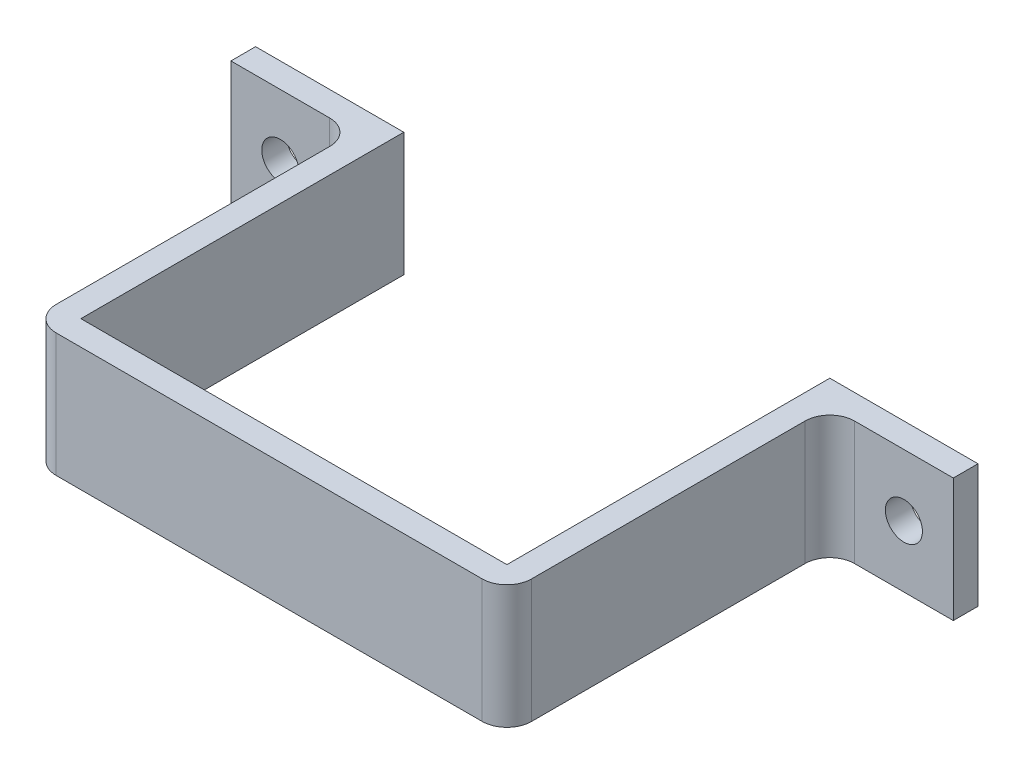
ISO-10303-21;
HEADER;
FILE_DESCRIPTION(('STEP AP214'),'2;1');
FILE_NAME('part.step','',(''),(''),'','','');
FILE_SCHEMA(('AUTOMOTIVE_DESIGN { 1 0 10303 214 1 1 1 1 }'));
ENDSEC;
DATA;
#1=APPLICATION_CONTEXT('core data for automotive mechanical design processes');
#2=APPLICATION_PROTOCOL_DEFINITION('international standard','automotive_design',2000,#1);
#3=PRODUCT_CONTEXT('',#1,'mechanical');
#4=PRODUCT('Part','Part','',(#3));
#5=PRODUCT_RELATED_PRODUCT_CATEGORY('part','',(#4));
#6=PRODUCT_DEFINITION_FORMATION('','',#4);
#7=PRODUCT_DEFINITION_CONTEXT('part definition',#1,'design');
#8=PRODUCT_DEFINITION('design','',#6,#7);
#9=PRODUCT_DEFINITION_SHAPE('','',#8);
#10=(LENGTH_UNIT() NAMED_UNIT(*) SI_UNIT(.MILLI.,.METRE.));
#11=(NAMED_UNIT(*) PLANE_ANGLE_UNIT() SI_UNIT($,.RADIAN.));
#12=(NAMED_UNIT(*) SI_UNIT($,.STERADIAN.) SOLID_ANGLE_UNIT());
#13=UNCERTAINTY_MEASURE_WITH_UNIT(LENGTH_MEASURE(1.E-05),#10,'distance_accuracy_value','');
#14=(GEOMETRIC_REPRESENTATION_CONTEXT(3) GLOBAL_UNCERTAINTY_ASSIGNED_CONTEXT((#13)) GLOBAL_UNIT_ASSIGNED_CONTEXT((#10,
#11,#12)) REPRESENTATION_CONTEXT('',''));
#15=CARTESIAN_POINT('',(0.,0.,0.));
#16=DIRECTION('',(0.,0.,1.));
#17=DIRECTION('',(1.,0.,0.));
#18=AXIS2_PLACEMENT_3D('',#15,#16,#17);
#19=CARTESIAN_POINT('',(0.,10.5450871627875,2.15));
#20=DIRECTION('',(0.,1.,0.));
#21=DIRECTION('',(0.,0.,1.));
#22=AXIS2_PLACEMENT_3D('',#19,#20,#21);
#23=PLANE('',#22);
#24=DIRECTION('',(0.,0.,1.));
#25=VECTOR('',#24,1.);
#26=CARTESIAN_POINT('',(-19.25,10.5450871627875,-36.1980390271856));
#27=LINE('',#26,#25);
#28=CARTESIAN_POINT('',(-19.25,10.5450871627875,-22.));
#29=VERTEX_POINT('',#28);
#30=CARTESIAN_POINT('',(-19.25,10.5450871627875,0.149999999999983));
#31=VERTEX_POINT('',#30);
#32=EDGE_CURVE('E244',#29,#31,#27,.T.);
#33=ORIENTED_EDGE('',*,*,#32,.T.);
#34=CARTESIAN_POINT('',(-17.25,10.5450871627875,0.15));
#35=DIRECTION('',(0.,1.,0.));
#36=DIRECTION('',(0.,0.,1.));
#37=AXIS2_PLACEMENT_3D('',#34,#35,#36);
#38=CIRCLE('',#37,2.);
#39=CARTESIAN_POINT('',(-17.25,10.5450871627875,2.15));
#40=VERTEX_POINT('',#39);
#41=EDGE_CURVE('E314',#31,#40,#38,.T.);
#42=ORIENTED_EDGE('',*,*,#41,.T.);
#43=DIRECTION('',(1.,0.,0.));
#44=VECTOR('',#43,1.);
#45=CARTESIAN_POINT('',(0.,10.5450871627875,2.15));
#46=LINE('',#45,#44);
#47=CARTESIAN_POINT('',(17.25,10.5450871627875,2.15));
#48=VERTEX_POINT('',#47);
#49=EDGE_CURVE('E267',#40,#48,#46,.T.);
#50=ORIENTED_EDGE('',*,*,#49,.T.);
#51=CARTESIAN_POINT('',(17.25,10.5450871627875,0.149999999999997));
#52=DIRECTION('',(0.,1.,0.));
#53=DIRECTION('',(0.,0.,1.));
#54=AXIS2_PLACEMENT_3D('',#51,#52,#53);
#55=CIRCLE('',#54,2.);
#56=CARTESIAN_POINT('',(19.25,10.5450871627875,0.149999999999983));
#57=VERTEX_POINT('',#56);
#58=EDGE_CURVE('E71',#48,#57,#55,.T.);
#59=ORIENTED_EDGE('',*,*,#58,.T.);
#60=DIRECTION('',(0.,0.,1.));
#61=VECTOR('',#60,1.);
#62=CARTESIAN_POINT('',(19.25,10.5450871627875,-36.1980390271856));
#63=LINE('',#62,#61);
#64=CARTESIAN_POINT('',(19.25,10.5450871627875,-22.));
#65=VERTEX_POINT('',#64);
#66=EDGE_CURVE('E232',#65,#57,#63,.T.);
#67=ORIENTED_EDGE('',*,*,#66,.F.);
#68=CARTESIAN_POINT('',(21.25,10.5450871627875,-22.));
#69=DIRECTION('',(0.,1.,0.));
#70=DIRECTION('',(0.,0.,1.));
#71=AXIS2_PLACEMENT_3D('',#68,#69,#70);
#72=CIRCLE('',#71,2.);
#73=CARTESIAN_POINT('',(21.25,10.5450871627875,-24.));
#74=VERTEX_POINT('',#73);
#75=EDGE_CURVE('E58',#65,#74,#72,.F.);
#76=ORIENTED_EDGE('',*,*,#75,.T.);
#77=DIRECTION('',(-1.,0.,0.));
#78=VECTOR('',#77,1.);
#79=CARTESIAN_POINT('',(29.25,10.5450871627875,-24.));
#80=LINE('',#79,#78);
#81=CARTESIAN_POINT('',(29.25,10.5450871627875,-24.));
#82=VERTEX_POINT('',#81);
#83=EDGE_CURVE('E187',#82,#74,#80,.T.);
#84=ORIENTED_EDGE('',*,*,#83,.F.);
#85=DIRECTION('',(0.,0.,-1.));
#86=VECTOR('',#85,1.);
#87=CARTESIAN_POINT('',(29.25,10.5450871627875,-26.));
#88=LINE('',#87,#86);
#89=CARTESIAN_POINT('',(29.25,10.5450871627875,-26.));
#90=VERTEX_POINT('',#89);
#91=EDGE_CURVE('E179',#82,#90,#88,.T.);
#92=ORIENTED_EDGE('',*,*,#91,.T.);
#93=DIRECTION('',(1.,0.,0.));
#94=VECTOR('',#93,1.);
#95=CARTESIAN_POINT('',(0.,10.5450871627876,-26.));
#96=LINE('',#95,#94);
#97=CARTESIAN_POINT('',(17.25,10.5450871627875,-26.));
#98=VERTEX_POINT('',#97);
#99=EDGE_CURVE('E163',#98,#90,#96,.T.);
#100=ORIENTED_EDGE('',*,*,#99,.F.);
#101=DIRECTION('',(0.,0.,1.));
#102=VECTOR('',#101,1.);
#103=CARTESIAN_POINT('',(17.25,10.5450871627875,-36.1980390271856));
#104=LINE('',#103,#102);
#105=CARTESIAN_POINT('',(17.25,10.5450871627875,0.149999999999983));
#106=VERTEX_POINT('',#105);
#107=EDGE_CURVE('E173',#98,#106,#104,.T.);
#108=ORIENTED_EDGE('',*,*,#107,.T.);
#109=DIRECTION('',(1.,0.,0.));
#110=VECTOR('',#109,1.);
#111=CARTESIAN_POINT('',(0.,10.5450871627875,0.15));
#112=LINE('',#111,#110);
#113=CARTESIAN_POINT('',(-17.25,10.5450871627875,0.15));
#114=VERTEX_POINT('',#113);
#115=EDGE_CURVE('E228',#114,#106,#112,.T.);
#116=ORIENTED_EDGE('',*,*,#115,.F.);
#117=DIRECTION('',(0.,0.,1.));
#118=VECTOR('',#117,1.);
#119=CARTESIAN_POINT('',(-17.25,10.5450871627875,-36.1980390271856));
#120=LINE('',#119,#118);
#121=CARTESIAN_POINT('',(-17.25,10.5450871627875,-26.));
#122=VERTEX_POINT('',#121);
#123=EDGE_CURVE('E248',#122,#114,#120,.T.);
#124=ORIENTED_EDGE('',*,*,#123,.F.);
#125=DIRECTION('',(-1.,0.,0.));
#126=VECTOR('',#125,1.);
#127=CARTESIAN_POINT('',(0.,10.5450871627876,-26.));
#128=LINE('',#127,#126);
#129=CARTESIAN_POINT('',(-29.25,10.5450871627875,-26.));
#130=VERTEX_POINT('',#129);
#131=EDGE_CURVE('E245',#122,#130,#128,.T.);
#132=ORIENTED_EDGE('',*,*,#131,.T.);
#133=DIRECTION('',(0.,0.,-1.));
#134=VECTOR('',#133,1.);
#135=CARTESIAN_POINT('',(-29.25,10.5450871627875,-26.));
#136=LINE('',#135,#134);
#137=CARTESIAN_POINT('',(-29.25,10.5450871627875,-24.));
#138=VERTEX_POINT('',#137);
#139=EDGE_CURVE('E213',#138,#130,#136,.T.);
#140=ORIENTED_EDGE('',*,*,#139,.F.);
#141=DIRECTION('',(1.,0.,0.));
#142=VECTOR('',#141,1.);
#143=CARTESIAN_POINT('',(-29.25,10.5450871627875,-24.));
#144=LINE('',#143,#142);
#145=CARTESIAN_POINT('',(-21.25,10.5450871627875,-24.));
#146=VERTEX_POINT('',#145);
#147=EDGE_CURVE('E217',#138,#146,#144,.T.);
#148=ORIENTED_EDGE('',*,*,#147,.T.);
#149=CARTESIAN_POINT('',(-21.25,10.5450871627875,-22.));
#150=DIRECTION('',(0.,1.,0.));
#151=DIRECTION('',(0.,0.,1.));
#152=AXIS2_PLACEMENT_3D('',#149,#150,#151);
#153=CIRCLE('',#152,2.);
#154=EDGE_CURVE('E328',#146,#29,#153,.F.);
#155=ORIENTED_EDGE('',*,*,#154,.T.);
#156=EDGE_LOOP('',(#33,#42,#50,#59,#67,#76,#84,#92,#100,#108,#116,#124,#132,#140,#148,#155));
#157=FACE_BOUND('',#156,.T.);
#158=ADVANCED_FACE('F48',(#157),#23,.T.);
#159=CARTESIAN_POINT('',(0.,0.545087162787469,2.15));
#160=DIRECTION('',(0.,1.,0.));
#161=DIRECTION('',(0.,0.,1.));
#162=AXIS2_PLACEMENT_3D('',#159,#160,#161);
#163=PLANE('',#162);
#164=DIRECTION('',(1.,0.,0.));
#165=VECTOR('',#164,1.);
#166=CARTESIAN_POINT('',(0.,0.545087162787469,2.15));
#167=LINE('',#166,#165);
#168=CARTESIAN_POINT('',(-17.25,0.545087162787469,2.15));
#169=VERTEX_POINT('',#168);
#170=CARTESIAN_POINT('',(17.25,0.545087162787469,2.15));
#171=VERTEX_POINT('',#170);
#172=EDGE_CURVE('E270',#169,#171,#167,.T.);
#173=ORIENTED_EDGE('',*,*,#172,.F.);
#174=CARTESIAN_POINT('',(-17.25,0.545087162787469,0.15));
#175=DIRECTION('',(0.,1.,0.));
#176=DIRECTION('',(0.,0.,1.));
#177=AXIS2_PLACEMENT_3D('',#174,#175,#176);
#178=CIRCLE('',#177,2.);
#179=CARTESIAN_POINT('',(-19.25,0.545087162787448,0.149999999999983));
#180=VERTEX_POINT('',#179);
#181=EDGE_CURVE('E309',#169,#180,#178,.F.);
#182=ORIENTED_EDGE('',*,*,#181,.T.);
#183=DIRECTION('',(0.,0.,1.));
#184=VECTOR('',#183,1.);
#185=CARTESIAN_POINT('',(-19.25,0.545087162787448,-36.1980390271856));
#186=LINE('',#185,#184);
#187=CARTESIAN_POINT('',(-19.25,0.545087162787448,-22.));
#188=VERTEX_POINT('',#187);
#189=EDGE_CURVE('E254',#188,#180,#186,.T.);
#190=ORIENTED_EDGE('',*,*,#189,.F.);
#191=CARTESIAN_POINT('',(-21.25,0.545087162787469,-22.));
#192=DIRECTION('',(0.,1.,0.));
#193=DIRECTION('',(0.,0.,1.));
#194=AXIS2_PLACEMENT_3D('',#191,#192,#193);
#195=CIRCLE('',#194,2.);
#196=CARTESIAN_POINT('',(-21.25,0.545087162787448,-24.));
#197=VERTEX_POINT('',#196);
#198=EDGE_CURVE('E331',#188,#197,#195,.T.);
#199=ORIENTED_EDGE('',*,*,#198,.T.);
#200=DIRECTION('',(1.,0.,0.));
#201=VECTOR('',#200,1.);
#202=CARTESIAN_POINT('',(-29.25,0.545087162787448,-24.));
#203=LINE('',#202,#201);
#204=CARTESIAN_POINT('',(-29.25,0.545087162787448,-24.));
#205=VERTEX_POINT('',#204);
#206=EDGE_CURVE('E221',#205,#197,#203,.T.);
#207=ORIENTED_EDGE('',*,*,#206,.F.);
#208=DIRECTION('',(0.,0.,1.));
#209=VECTOR('',#208,1.);
#210=CARTESIAN_POINT('',(-29.25,0.545087162787448,-26.));
#211=LINE('',#210,#209);
#212=CARTESIAN_POINT('',(-29.25,0.545087162787448,-26.));
#213=VERTEX_POINT('',#212);
#214=EDGE_CURVE('E207',#213,#205,#211,.T.);
#215=ORIENTED_EDGE('',*,*,#214,.F.);
#216=DIRECTION('',(-1.,0.,0.));
#217=VECTOR('',#216,1.);
#218=CARTESIAN_POINT('',(0.,0.545087162787655,-26.));
#219=LINE('',#218,#217);
#220=CARTESIAN_POINT('',(-17.25,0.545087162787469,-26.));
#221=VERTEX_POINT('',#220);
#222=EDGE_CURVE('E251',#221,#213,#219,.T.);
#223=ORIENTED_EDGE('',*,*,#222,.F.);
#224=DIRECTION('',(0.,0.,1.));
#225=VECTOR('',#224,1.);
#226=CARTESIAN_POINT('',(-17.25,0.545087162787469,-36.1980390271856));
#227=LINE('',#226,#225);
#228=CARTESIAN_POINT('',(-17.25,0.545087162787469,0.149999999999983));
#229=VERTEX_POINT('',#228);
#230=EDGE_CURVE('E258',#221,#229,#227,.T.);
#231=ORIENTED_EDGE('',*,*,#230,.T.);
#232=DIRECTION('',(1.,0.,0.));
#233=VECTOR('',#232,1.);
#234=CARTESIAN_POINT('',(0.,0.545087162787469,0.15));
#235=LINE('',#234,#233);
#236=CARTESIAN_POINT('',(17.25,0.545087162787469,0.15));
#237=VERTEX_POINT('',#236);
#238=EDGE_CURVE('E283',#229,#237,#235,.T.);
#239=ORIENTED_EDGE('',*,*,#238,.T.);
#240=DIRECTION('',(0.,0.,1.));
#241=VECTOR('',#240,1.);
#242=CARTESIAN_POINT('',(17.25,0.545087162787469,-36.1980390271856));
#243=LINE('',#242,#241);
#244=CARTESIAN_POINT('',(17.25,0.545087162787469,-26.));
#245=VERTEX_POINT('',#244);
#246=EDGE_CURVE('E237',#245,#237,#243,.T.);
#247=ORIENTED_EDGE('',*,*,#246,.F.);
#248=DIRECTION('',(1.,0.,0.));
#249=VECTOR('',#248,1.);
#250=CARTESIAN_POINT('',(0.,0.545087162787617,-26.));
#251=LINE('',#250,#249);
#252=CARTESIAN_POINT('',(29.25,0.545087162787448,-26.));
#253=VERTEX_POINT('',#252);
#254=EDGE_CURVE('E229',#245,#253,#251,.T.);
#255=ORIENTED_EDGE('',*,*,#254,.T.);
#256=DIRECTION('',(0.,0.,1.));
#257=VECTOR('',#256,1.);
#258=CARTESIAN_POINT('',(29.25,0.545087162787448,-26.));
#259=LINE('',#258,#257);
#260=CARTESIAN_POINT('',(29.25,0.545087162787448,-24.));
#261=VERTEX_POINT('',#260);
#262=EDGE_CURVE('E182',#253,#261,#259,.T.);
#263=ORIENTED_EDGE('',*,*,#262,.T.);
#264=DIRECTION('',(-1.,0.,0.));
#265=VECTOR('',#264,1.);
#266=CARTESIAN_POINT('',(29.25,0.545087162787448,-24.));
#267=LINE('',#266,#265);
#268=CARTESIAN_POINT('',(21.25,0.545087162787448,-24.));
#269=VERTEX_POINT('',#268);
#270=EDGE_CURVE('E197',#261,#269,#267,.T.);
#271=ORIENTED_EDGE('',*,*,#270,.T.);
#272=CARTESIAN_POINT('',(21.25,0.545087162787469,-22.));
#273=DIRECTION('',(0.,1.,0.));
#274=DIRECTION('',(0.,0.,1.));
#275=AXIS2_PLACEMENT_3D('',#272,#273,#274);
#276=CIRCLE('',#275,2.);
#277=CARTESIAN_POINT('',(19.25,0.545087162787452,-22.));
#278=VERTEX_POINT('',#277);
#279=EDGE_CURVE('E12',#269,#278,#276,.T.);
#280=ORIENTED_EDGE('',*,*,#279,.T.);
#281=DIRECTION('',(0.,0.,1.));
#282=VECTOR('',#281,1.);
#283=CARTESIAN_POINT('',(19.25,0.545087162787452,-36.1980390271856));
#284=LINE('',#283,#282);
#285=CARTESIAN_POINT('',(19.25,0.545087162787452,0.149999999999983));
#286=VERTEX_POINT('',#285);
#287=EDGE_CURVE('E231',#278,#286,#284,.T.);
#288=ORIENTED_EDGE('',*,*,#287,.T.);
#289=CARTESIAN_POINT('',(17.25,0.545087162787469,0.149999999999997));
#290=DIRECTION('',(0.,1.,0.));
#291=DIRECTION('',(0.,0.,1.));
#292=AXIS2_PLACEMENT_3D('',#289,#290,#291);
#293=CIRCLE('',#292,2.);
#294=EDGE_CURVE('E306',#286,#171,#293,.F.);
#295=ORIENTED_EDGE('',*,*,#294,.T.);
#296=EDGE_LOOP('',(#173,#182,#190,#199,#207,#215,#223,#231,#239,#247,#255,#263,#271,#280,#288,#295));
#297=FACE_BOUND('',#296,.T.);
#298=ADVANCED_FACE('F372',(#297),#163,.F.);
#299=CARTESIAN_POINT('',(0.,0.,2.15));
#300=DIRECTION('',(0.,0.,1.));
#301=DIRECTION('',(1.,0.,0.));
#302=AXIS2_PLACEMENT_3D('',#299,#300,#301);
#303=PLANE('',#302);
#304=ORIENTED_EDGE('',*,*,#49,.F.);
#305=DIRECTION('',(0.,-1.,0.));
#306=VECTOR('',#305,1.);
#307=CARTESIAN_POINT('',(-17.25,0.,2.15));
#308=LINE('',#307,#306);
#309=EDGE_CURVE('E302',#40,#169,#308,.T.);
#310=ORIENTED_EDGE('',*,*,#309,.T.);
#311=ORIENTED_EDGE('',*,*,#172,.T.);
#312=DIRECTION('',(0.,-1.,0.));
#313=VECTOR('',#312,1.);
#314=CARTESIAN_POINT('',(17.25,10.5450871627875,2.15));
#315=LINE('',#314,#313);
#316=EDGE_CURVE('E299',#171,#48,#315,.F.);
#317=ORIENTED_EDGE('',*,*,#316,.T.);
#318=EDGE_LOOP('',(#304,#310,#311,#317));
#319=FACE_BOUND('',#318,.T.);
#320=ADVANCED_FACE('F378',(#319),#303,.T.);
#321=CARTESIAN_POINT('',(0.,0.,0.15));
#322=DIRECTION('',(0.,0.,1.));
#323=DIRECTION('',(1.,0.,0.));
#324=AXIS2_PLACEMENT_3D('',#321,#322,#323);
#325=PLANE('',#324);
#326=ORIENTED_EDGE('',*,*,#115,.T.);
#327=DIRECTION('',(0.,-1.,0.));
#328=VECTOR('',#327,1.);
#329=CARTESIAN_POINT('',(17.25,0.,0.15));
#330=LINE('',#329,#328);
#331=EDGE_CURVE('E271',#106,#237,#330,.T.);
#332=ORIENTED_EDGE('',*,*,#331,.T.);
#333=ORIENTED_EDGE('',*,*,#238,.F.);
#334=DIRECTION('',(0.,-1.,0.));
#335=VECTOR('',#334,1.);
#336=CARTESIAN_POINT('',(-17.25,0.,0.15));
#337=LINE('',#336,#335);
#338=EDGE_CURVE('E279',#114,#229,#337,.T.);
#339=ORIENTED_EDGE('',*,*,#338,.F.);
#340=EDGE_LOOP('',(#326,#332,#333,#339));
#341=FACE_BOUND('',#340,.T.);
#342=ADVANCED_FACE('F412',(#341),#325,.F.);
#343=CARTESIAN_POINT('',(19.25,0.,-36.1980390271856));
#344=DIRECTION('',(-1.,0.,0.));
#345=DIRECTION('',(0.,0.,1.));
#346=AXIS2_PLACEMENT_3D('',#343,#344,#345);
#347=PLANE('',#346);
#348=ORIENTED_EDGE('',*,*,#66,.T.);
#349=DIRECTION('',(0.,-1.,0.));
#350=VECTOR('',#349,1.);
#351=CARTESIAN_POINT('',(19.25,0.545087162787452,0.149999999999997));
#352=LINE('',#351,#350);
#353=EDGE_CURVE('E321',#57,#286,#352,.T.);
#354=ORIENTED_EDGE('',*,*,#353,.T.);
#355=ORIENTED_EDGE('',*,*,#287,.F.);
#356=DIRECTION('',(0.,1.,0.));
#357=VECTOR('',#356,1.);
#358=CARTESIAN_POINT('',(19.25,0.,-22.));
#359=LINE('',#358,#357);
#360=EDGE_CURVE('E317',#278,#65,#359,.T.);
#361=ORIENTED_EDGE('',*,*,#360,.T.);
#362=EDGE_LOOP('',(#348,#354,#355,#361));
#363=FACE_BOUND('',#362,.T.);
#364=ADVANCED_FACE('F367',(#363),#347,.F.);
#365=CARTESIAN_POINT('',(17.25,0.,-36.1980390271856));
#366=DIRECTION('',(1.,0.,0.));
#367=DIRECTION('',(0.,0.,-1.));
#368=AXIS2_PLACEMENT_3D('',#365,#366,#367);
#369=PLANE('',#368);
#370=ORIENTED_EDGE('',*,*,#331,.F.);
#371=ORIENTED_EDGE('',*,*,#107,.F.);
#372=DIRECTION('',(0.,1.,0.));
#373=VECTOR('',#372,1.);
#374=CARTESIAN_POINT('',(17.25,0.,-26.));
#375=LINE('',#374,#373);
#376=EDGE_CURVE('E169',#245,#98,#375,.T.);
#377=ORIENTED_EDGE('',*,*,#376,.F.);
#378=ORIENTED_EDGE('',*,*,#246,.T.);
#379=EDGE_LOOP('',(#370,#371,#377,#378));
#380=FACE_BOUND('',#379,.T.);
#381=ADVANCED_FACE('F356',(#380),#369,.F.);
#382=CARTESIAN_POINT('',(0.,0.,-26.));
#383=DIRECTION('',(0.,0.,-1.));
#384=DIRECTION('',(0.,1.,0.));
#385=AXIS2_PLACEMENT_3D('',#382,#383,#384);
#386=PLANE('',#385);
#387=CARTESIAN_POINT('',(25.25,5.54508716278745,-26.));
#388=DIRECTION('',(0.,0.,-1.));
#389=DIRECTION('',(-1.,0.,0.));
#390=AXIS2_PLACEMENT_3D('',#387,#388,#389);
#391=CIRCLE('',#390,1.5);
#392=CARTESIAN_POINT('',(23.75,5.54508716278745,-26.));
#393=VERTEX_POINT('',#392);
#394=EDGE_CURVE('E346',#393,#393,#391,.T.);
#395=ORIENTED_EDGE('',*,*,#394,.F.);
#396=EDGE_LOOP('',(#395));
#397=FACE_BOUND('',#396,.T.);
#398=ORIENTED_EDGE('',*,*,#99,.T.);
#399=DIRECTION('',(0.,-1.,0.));
#400=VECTOR('',#399,1.);
#401=CARTESIAN_POINT('',(29.25,10.5450871627875,-26.));
#402=LINE('',#401,#400);
#403=EDGE_CURVE('E167',#90,#253,#402,.T.);
#404=ORIENTED_EDGE('',*,*,#403,.T.);
#405=ORIENTED_EDGE('',*,*,#254,.F.);
#406=ORIENTED_EDGE('',*,*,#376,.T.);
#407=EDGE_LOOP('',(#398,#404,#405,#406));
#408=FACE_BOUND('',#407,.T.);
#409=ADVANCED_FACE('F165',(#397,#408),#386,.T.);
#410=CARTESIAN_POINT('',(-17.25,0.,-36.1980390271856));
#411=DIRECTION('',(-1.,0.,0.));
#412=DIRECTION('',(0.,0.,1.));
#413=AXIS2_PLACEMENT_3D('',#410,#411,#412);
#414=PLANE('',#413);
#415=ORIENTED_EDGE('',*,*,#123,.T.);
#416=ORIENTED_EDGE('',*,*,#338,.T.);
#417=ORIENTED_EDGE('',*,*,#230,.F.);
#418=DIRECTION('',(0.,-1.,0.));
#419=VECTOR('',#418,1.);
#420=CARTESIAN_POINT('',(-17.25,0.,-26.));
#421=LINE('',#420,#419);
#422=EDGE_CURVE('E225',#122,#221,#421,.T.);
#423=ORIENTED_EDGE('',*,*,#422,.F.);
#424=EDGE_LOOP('',(#415,#416,#417,#423));
#425=FACE_BOUND('',#424,.T.);
#426=ADVANCED_FACE('F355',(#425),#414,.F.);
#427=CARTESIAN_POINT('',(0.,0.,-26.));
#428=DIRECTION('',(0.,0.,-1.));
#429=DIRECTION('',(0.,1.,0.));
#430=AXIS2_PLACEMENT_3D('',#427,#428,#429);
#431=PLANE('',#430);
#432=CARTESIAN_POINT('',(-25.25,5.54508716278745,-26.));
#433=DIRECTION('',(0.,0.,-1.));
#434=DIRECTION('',(-1.,0.,0.));
#435=AXIS2_PLACEMENT_3D('',#432,#433,#434);
#436=CIRCLE('',#435,1.5);
#437=CARTESIAN_POINT('',(-26.75,5.54508716278745,-26.));
#438=VERTEX_POINT('',#437);
#439=EDGE_CURVE('E337',#438,#438,#436,.F.);
#440=ORIENTED_EDGE('',*,*,#439,.T.);
#441=EDGE_LOOP('',(#440));
#442=FACE_BOUND('',#441,.T.);
#443=ORIENTED_EDGE('',*,*,#131,.F.);
#444=ORIENTED_EDGE('',*,*,#422,.T.);
#445=ORIENTED_EDGE('',*,*,#222,.T.);
#446=DIRECTION('',(0.,-1.,0.));
#447=VECTOR('',#446,1.);
#448=CARTESIAN_POINT('',(-29.25,10.5450871627875,-26.));
#449=LINE('',#448,#447);
#450=EDGE_CURVE('E203',#130,#213,#449,.T.);
#451=ORIENTED_EDGE('',*,*,#450,.F.);
#452=EDGE_LOOP('',(#443,#444,#445,#451));
#453=FACE_BOUND('',#452,.T.);
#454=ADVANCED_FACE('F363',(#442,#453),#431,.T.);
#455=CARTESIAN_POINT('',(-19.25,0.,-36.1980390271856));
#456=DIRECTION('',(-1.,0.,0.));
#457=DIRECTION('',(0.,0.,1.));
#458=AXIS2_PLACEMENT_3D('',#455,#456,#457);
#459=PLANE('',#458);
#460=ORIENTED_EDGE('',*,*,#32,.F.);
#461=DIRECTION('',(0.,1.,0.));
#462=VECTOR('',#461,1.);
#463=CARTESIAN_POINT('',(-19.25,0.,-22.));
#464=LINE('',#463,#462);
#465=EDGE_CURVE('E296',#29,#188,#464,.F.);
#466=ORIENTED_EDGE('',*,*,#465,.T.);
#467=ORIENTED_EDGE('',*,*,#189,.T.);
#468=DIRECTION('',(0.,-1.,0.));
#469=VECTOR('',#468,1.);
#470=CARTESIAN_POINT('',(-19.25,0.,0.149999999999997));
#471=LINE('',#470,#469);
#472=EDGE_CURVE('E293',#180,#31,#471,.F.);
#473=ORIENTED_EDGE('',*,*,#472,.T.);
#474=EDGE_LOOP('',(#460,#466,#467,#473));
#475=FACE_BOUND('',#474,.T.);
#476=ADVANCED_FACE('F432',(#475),#459,.T.);
#477=CARTESIAN_POINT('',(-29.25,10.5450871627875,-24.));
#478=DIRECTION('',(0.,0.,-1.));
#479=DIRECTION('',(-1.,0.,0.));
#480=AXIS2_PLACEMENT_3D('',#477,#478,#479);
#481=PLANE('',#480);
#482=CARTESIAN_POINT('',(-25.25,5.54508716278745,-24.));
#483=DIRECTION('',(0.,0.,-1.));
#484=DIRECTION('',(-1.,0.,0.));
#485=AXIS2_PLACEMENT_3D('',#482,#483,#484);
#486=CIRCLE('',#485,1.5);
#487=CARTESIAN_POINT('',(-26.75,5.54508716278745,-24.));
#488=VERTEX_POINT('',#487);
#489=EDGE_CURVE('E184',#488,#488,#486,.T.);
#490=ORIENTED_EDGE('',*,*,#489,.T.);
#491=EDGE_LOOP('',(#490));
#492=FACE_BOUND('',#491,.T.);
#493=ORIENTED_EDGE('',*,*,#206,.T.);
#494=DIRECTION('',(0.,1.,0.));
#495=VECTOR('',#494,1.);
#496=CARTESIAN_POINT('',(-21.25,10.5450871627875,-24.));
#497=LINE('',#496,#495);
#498=EDGE_CURVE('E275',#197,#146,#497,.T.);
#499=ORIENTED_EDGE('',*,*,#498,.T.);
#500=ORIENTED_EDGE('',*,*,#147,.F.);
#501=DIRECTION('',(0.,1.,0.));
#502=VECTOR('',#501,1.);
#503=CARTESIAN_POINT('',(-29.25,10.5450871627875,-24.));
#504=LINE('',#503,#502);
#505=EDGE_CURVE('E210',#205,#138,#504,.T.);
#506=ORIENTED_EDGE('',*,*,#505,.F.);
#507=EDGE_LOOP('',(#493,#499,#500,#506));
#508=FACE_BOUND('',#507,.T.);
#509=ADVANCED_FACE('F426',(#492,#508),#481,.F.);
#510=CARTESIAN_POINT('',(-29.25,0.,0.));
#511=DIRECTION('',(-1.,0.,0.));
#512=DIRECTION('',(0.,0.,1.));
#513=AXIS2_PLACEMENT_3D('',#510,#511,#512);
#514=PLANE('',#513);
#515=ORIENTED_EDGE('',*,*,#450,.T.);
#516=ORIENTED_EDGE('',*,*,#214,.T.);
#517=ORIENTED_EDGE('',*,*,#505,.T.);
#518=ORIENTED_EDGE('',*,*,#139,.T.);
#519=EDGE_LOOP('',(#515,#516,#517,#518));
#520=FACE_BOUND('',#519,.T.);
#521=ADVANCED_FACE('F422',(#520),#514,.T.);
#522=CARTESIAN_POINT('',(29.25,10.5450871627875,-24.));
#523=DIRECTION('',(0.,0.,1.));
#524=DIRECTION('',(1.,0.,0.));
#525=AXIS2_PLACEMENT_3D('',#522,#523,#524);
#526=PLANE('',#525);
#527=CARTESIAN_POINT('',(25.25,5.54508716278745,-24.));
#528=DIRECTION('',(0.,0.,1.));
#529=DIRECTION('',(1.,0.,0.));
#530=AXIS2_PLACEMENT_3D('',#527,#528,#529);
#531=CIRCLE('',#530,1.5);
#532=CARTESIAN_POINT('',(26.75,5.54508716278745,-24.));
#533=VERTEX_POINT('',#532);
#534=EDGE_CURVE('E52',#533,#533,#531,.F.);
#535=ORIENTED_EDGE('',*,*,#534,.T.);
#536=EDGE_LOOP('',(#535));
#537=FACE_BOUND('',#536,.T.);
#538=ORIENTED_EDGE('',*,*,#83,.T.);
#539=DIRECTION('',(0.,1.,0.));
#540=VECTOR('',#539,1.);
#541=CARTESIAN_POINT('',(21.25,10.5450871627875,-24.));
#542=LINE('',#541,#540);
#543=EDGE_CURVE('E325',#74,#269,#542,.F.);
#544=ORIENTED_EDGE('',*,*,#543,.T.);
#545=ORIENTED_EDGE('',*,*,#270,.F.);
#546=DIRECTION('',(0.,1.,0.));
#547=VECTOR('',#546,1.);
#548=CARTESIAN_POINT('',(29.25,10.5450871627875,-24.));
#549=LINE('',#548,#547);
#550=EDGE_CURVE('E189',#261,#82,#549,.T.);
#551=ORIENTED_EDGE('',*,*,#550,.T.);
#552=EDGE_LOOP('',(#538,#544,#545,#551));
#553=FACE_BOUND('',#552,.T.);
#554=ADVANCED_FACE('F407',(#537,#553),#526,.T.);
#555=CARTESIAN_POINT('',(29.25,0.,0.));
#556=DIRECTION('',(1.,0.,0.));
#557=DIRECTION('',(0.,0.,1.));
#558=AXIS2_PLACEMENT_3D('',#555,#556,#557);
#559=PLANE('',#558);
#560=ORIENTED_EDGE('',*,*,#403,.F.);
#561=ORIENTED_EDGE('',*,*,#91,.F.);
#562=ORIENTED_EDGE('',*,*,#550,.F.);
#563=ORIENTED_EDGE('',*,*,#262,.F.);
#564=EDGE_LOOP('',(#560,#561,#562,#563));
#565=FACE_BOUND('',#564,.T.);
#566=ADVANCED_FACE('F177',(#565),#559,.T.);
#567=CARTESIAN_POINT('',(-21.25,10.5450871627875,-22.));
#568=DIRECTION('',(0.,1.,0.));
#569=DIRECTION('',(0.,0.,1.));
#570=AXIS2_PLACEMENT_3D('',#567,#568,#569);
#571=CYLINDRICAL_SURFACE('',#570,2.);
#572=ORIENTED_EDGE('',*,*,#198,.F.);
#573=ORIENTED_EDGE('',*,*,#465,.F.);
#574=ORIENTED_EDGE('',*,*,#154,.F.);
#575=ORIENTED_EDGE('',*,*,#498,.F.);
#576=EDGE_LOOP('',(#572,#573,#574,#575));
#577=FACE_BOUND('',#576,.T.);
#578=ADVANCED_FACE('F383',(#577),#571,.F.);
#579=CARTESIAN_POINT('',(-17.25,0.,0.15));
#580=DIRECTION('',(0.,-1.,0.));
#581=DIRECTION('',(0.,0.,-1.));
#582=AXIS2_PLACEMENT_3D('',#579,#580,#581);
#583=CYLINDRICAL_SURFACE('',#582,2.);
#584=ORIENTED_EDGE('',*,*,#41,.F.);
#585=ORIENTED_EDGE('',*,*,#472,.F.);
#586=ORIENTED_EDGE('',*,*,#181,.F.);
#587=ORIENTED_EDGE('',*,*,#309,.F.);
#588=EDGE_LOOP('',(#584,#585,#586,#587));
#589=FACE_BOUND('',#588,.T.);
#590=ADVANCED_FACE('F386',(#589),#583,.T.);
#591=CARTESIAN_POINT('',(17.25,0.,0.149999999999997));
#592=DIRECTION('',(0.,1.,0.));
#593=DIRECTION('',(0.,0.,1.));
#594=AXIS2_PLACEMENT_3D('',#591,#592,#593);
#595=CYLINDRICAL_SURFACE('',#594,2.);
#596=ORIENTED_EDGE('',*,*,#58,.F.);
#597=ORIENTED_EDGE('',*,*,#316,.F.);
#598=ORIENTED_EDGE('',*,*,#294,.F.);
#599=ORIENTED_EDGE('',*,*,#353,.F.);
#600=EDGE_LOOP('',(#596,#597,#598,#599));
#601=FACE_BOUND('',#600,.T.);
#602=ADVANCED_FACE('F389',(#601),#595,.T.);
#603=CARTESIAN_POINT('',(21.25,0.,-22.));
#604=DIRECTION('',(0.,1.,0.));
#605=DIRECTION('',(0.,0.,1.));
#606=AXIS2_PLACEMENT_3D('',#603,#604,#605);
#607=CYLINDRICAL_SURFACE('',#606,2.);
#608=ORIENTED_EDGE('',*,*,#279,.F.);
#609=ORIENTED_EDGE('',*,*,#543,.F.);
#610=ORIENTED_EDGE('',*,*,#75,.F.);
#611=ORIENTED_EDGE('',*,*,#360,.F.);
#612=EDGE_LOOP('',(#608,#609,#610,#611));
#613=FACE_BOUND('',#612,.T.);
#614=ADVANCED_FACE('F50',(#613),#607,.F.);
#615=CARTESIAN_POINT('',(-25.25,5.54508716278745,-30.2426406871193));
#616=DIRECTION('',(0.,0.,1.));
#617=DIRECTION('',(1.,0.,0.));
#618=AXIS2_PLACEMENT_3D('',#615,#616,#617);
#619=CYLINDRICAL_SURFACE('',#618,1.5);
#620=ORIENTED_EDGE('',*,*,#439,.F.);
#621=EDGE_LOOP('',(#620));
#622=FACE_BOUND('',#621,.T.);
#623=ORIENTED_EDGE('',*,*,#489,.F.);
#624=EDGE_LOOP('',(#623));
#625=FACE_BOUND('',#624,.T.);
#626=ADVANCED_FACE('F396',(#622,#625),#619,.F.);
#627=CARTESIAN_POINT('',(25.25,5.54508716278745,-30.2426406871193));
#628=DIRECTION('',(0.,0.,1.));
#629=DIRECTION('',(1.,0.,0.));
#630=AXIS2_PLACEMENT_3D('',#627,#628,#629);
#631=CYLINDRICAL_SURFACE('',#630,1.5);
#632=ORIENTED_EDGE('',*,*,#534,.F.);
#633=EDGE_LOOP('',(#632));
#634=FACE_BOUND('',#633,.T.);
#635=ORIENTED_EDGE('',*,*,#394,.T.);
#636=EDGE_LOOP('',(#635));
#637=FACE_BOUND('',#636,.T.);
#638=ADVANCED_FACE('F352',(#634,#637),#631,.F.);
#639=CLOSED_SHELL('',(#158,#298,#320,#342,#364,#381,#409,#426,#454,#476,#509,#521,#554,#566,
#578,#590,#602,#614,#626,#638));
#640=MANIFOLD_SOLID_BREP('B2',#639);
#641=ADVANCED_BREP_SHAPE_REPRESENTATION('',(#18,#640),#14);
#642=SHAPE_DEFINITION_REPRESENTATION(#9,#641);
ENDSEC;
END-ISO-10303-21;
